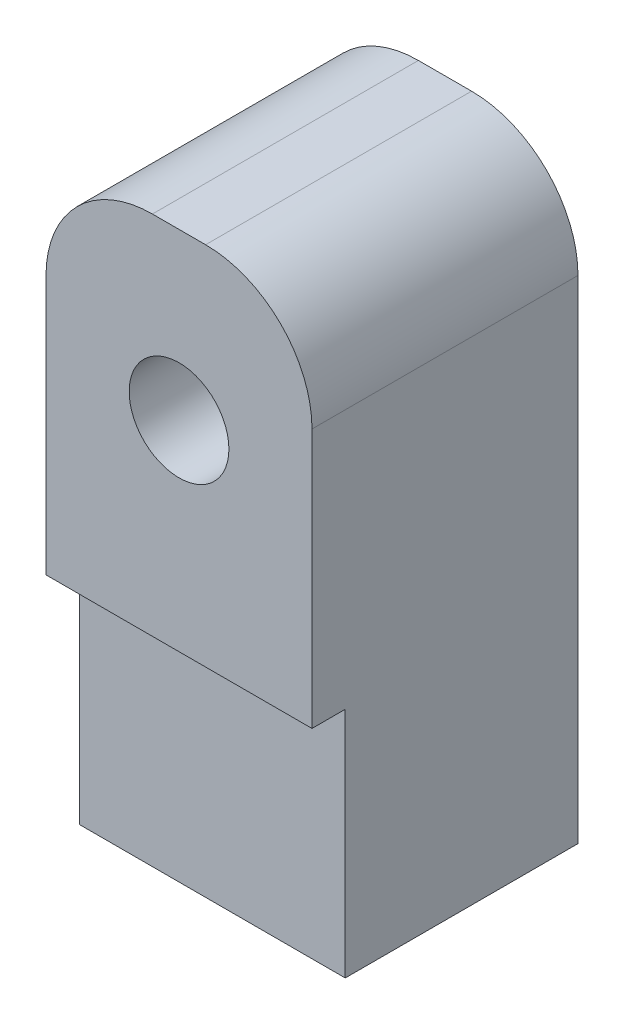
ISO-10303-21;
HEADER;
FILE_DESCRIPTION(('STEP AP214'),'2;1');
FILE_NAME('part.step','',(''),(''),'','','');
FILE_SCHEMA(('AUTOMOTIVE_DESIGN { 1 0 10303 214 1 1 1 1 }'));
ENDSEC;
DATA;
#1=APPLICATION_CONTEXT('core data for automotive mechanical design processes');
#2=APPLICATION_PROTOCOL_DEFINITION('international standard','automotive_design',2000,#1);
#3=PRODUCT_CONTEXT('',#1,'mechanical');
#4=PRODUCT('Part','Part','',(#3));
#5=PRODUCT_RELATED_PRODUCT_CATEGORY('part','',(#4));
#6=PRODUCT_DEFINITION_FORMATION('','',#4);
#7=PRODUCT_DEFINITION_CONTEXT('part definition',#1,'design');
#8=PRODUCT_DEFINITION('design','',#6,#7);
#9=PRODUCT_DEFINITION_SHAPE('','',#8);
#10=(LENGTH_UNIT() NAMED_UNIT(*) SI_UNIT(.MILLI.,.METRE.));
#11=(NAMED_UNIT(*) PLANE_ANGLE_UNIT() SI_UNIT($,.RADIAN.));
#12=(NAMED_UNIT(*) SI_UNIT($,.STERADIAN.) SOLID_ANGLE_UNIT());
#13=UNCERTAINTY_MEASURE_WITH_UNIT(LENGTH_MEASURE(1.E-05),#10,'distance_accuracy_value','');
#14=(GEOMETRIC_REPRESENTATION_CONTEXT(3) GLOBAL_UNCERTAINTY_ASSIGNED_CONTEXT((#13)) GLOBAL_UNIT_ASSIGNED_CONTEXT((#10,
#11,#12)) REPRESENTATION_CONTEXT('',''));
#15=CARTESIAN_POINT('',(0.,0.,0.));
#16=DIRECTION('',(0.,0.,1.));
#17=DIRECTION('',(1.,0.,0.));
#18=AXIS2_PLACEMENT_3D('',#15,#16,#17);
#19=CARTESIAN_POINT('',(0.00208552515346321,41.3626449830756,-12.7));
#20=DIRECTION('',(0.,0.,1.));
#21=DIRECTION('',(1.,0.,0.));
#22=AXIS2_PLACEMENT_3D('',#19,#20,#21);
#23=CYLINDRICAL_SURFACE('',#22,4.7625);
#24=CARTESIAN_POINT('',(0.00208552515346321,41.3626449830756,12.7));
#25=DIRECTION('',(0.,0.,1.));
#26=DIRECTION('',(1.,0.,0.));
#27=AXIS2_PLACEMENT_3D('',#24,#25,#26);
#28=CIRCLE('',#27,4.7625);
#29=CARTESIAN_POINT('',(4.76458552515346,41.3626449830756,12.7));
#30=VERTEX_POINT('',#29);
#31=EDGE_CURVE('E152',#30,#30,#28,.T.);
#32=ORIENTED_EDGE('',*,*,#31,.T.);
#33=EDGE_LOOP('',(#32));
#34=FACE_BOUND('',#33,.T.);
#35=CARTESIAN_POINT('',(0.00208552515346321,41.3626449830756,-9.525));
#36=DIRECTION('',(0.,0.,-1.));
#37=DIRECTION('',(-1.,0.,0.));
#38=AXIS2_PLACEMENT_3D('',#35,#36,#37);
#39=CIRCLE('',#38,4.7625);
#40=CARTESIAN_POINT('',(-4.76041447484654,41.3626449830756,-9.525));
#41=VERTEX_POINT('',#40);
#42=EDGE_CURVE('E149',#41,#41,#39,.F.);
#43=ORIENTED_EDGE('',*,*,#42,.F.);
#44=EDGE_LOOP('',(#43));
#45=FACE_BOUND('',#44,.T.);
#46=ADVANCED_FACE('F33',(#34,#45),#23,.F.);
#47=CARTESIAN_POINT('',(-12.7,57.15,12.7));
#48=DIRECTION('',(0.,0.,-1.));
#49=DIRECTION('',(-1.,0.,0.));
#50=AXIS2_PLACEMENT_3D('',#47,#48,#49);
#51=PLANE('',#50);
#52=ORIENTED_EDGE('',*,*,#31,.F.);
#53=EDGE_LOOP('',(#52));
#54=FACE_BOUND('',#53,.T.);
#55=DIRECTION('',(1.,0.,0.));
#56=VECTOR('',#55,1.);
#57=CARTESIAN_POINT('',(-12.7,57.15,12.7));
#58=LINE('',#57,#56);
#59=CARTESIAN_POINT('',(-2.53999999999999,57.15,12.7));
#60=VERTEX_POINT('',#59);
#61=CARTESIAN_POINT('',(2.54000000000001,57.15,12.7));
#62=VERTEX_POINT('',#61);
#63=EDGE_CURVE('E131',#60,#62,#58,.T.);
#64=ORIENTED_EDGE('',*,*,#63,.F.);
#65=CARTESIAN_POINT('',(-2.53999999999999,46.99,12.7));
#66=DIRECTION('',(0.,0.,-1.));
#67=DIRECTION('',(-1.,0.,0.));
#68=AXIS2_PLACEMENT_3D('',#65,#66,#67);
#69=CIRCLE('',#68,10.16);
#70=CARTESIAN_POINT('',(-12.7,46.99,12.7));
#71=VERTEX_POINT('',#70);
#72=EDGE_CURVE('E161',#60,#71,#69,.F.);
#73=ORIENTED_EDGE('',*,*,#72,.T.);
#74=DIRECTION('',(0.,-1.,0.));
#75=VECTOR('',#74,1.);
#76=CARTESIAN_POINT('',(-12.7,57.15,12.7));
#77=LINE('',#76,#75);
#78=CARTESIAN_POINT('',(-12.7,22.225,12.7));
#79=VERTEX_POINT('',#78);
#80=EDGE_CURVE('E142',#71,#79,#77,.T.);
#81=ORIENTED_EDGE('',*,*,#80,.T.);
#82=DIRECTION('',(-1.,0.,0.));
#83=VECTOR('',#82,1.);
#84=CARTESIAN_POINT('',(12.7,22.225,12.7));
#85=LINE('',#84,#83);
#86=CARTESIAN_POINT('',(12.7,22.225,12.7));
#87=VERTEX_POINT('',#86);
#88=EDGE_CURVE('E115',#87,#79,#85,.T.);
#89=ORIENTED_EDGE('',*,*,#88,.F.);
#90=DIRECTION('',(0.,-1.,0.));
#91=VECTOR('',#90,1.);
#92=CARTESIAN_POINT('',(12.7,57.15,12.7));
#93=LINE('',#92,#91);
#94=CARTESIAN_POINT('',(12.7,46.99,12.7));
#95=VERTEX_POINT('',#94);
#96=EDGE_CURVE('E134',#95,#87,#93,.T.);
#97=ORIENTED_EDGE('',*,*,#96,.F.);
#98=CARTESIAN_POINT('',(2.54000000000001,46.99,12.7));
#99=DIRECTION('',(0.,0.,-1.));
#100=DIRECTION('',(-1.,0.,0.));
#101=AXIS2_PLACEMENT_3D('',#98,#99,#100);
#102=CIRCLE('',#101,10.16);
#103=EDGE_CURVE('E159',#95,#62,#102,.F.);
#104=ORIENTED_EDGE('',*,*,#103,.T.);
#105=EDGE_LOOP('',(#64,#73,#81,#89,#97,#104));
#106=FACE_BOUND('',#105,.T.);
#107=ADVANCED_FACE('F174',(#54,#106),#51,.F.);
#108=CARTESIAN_POINT('',(12.7,57.15,12.7));
#109=DIRECTION('',(-1.,0.,0.));
#110=DIRECTION('',(0.,0.,1.));
#111=AXIS2_PLACEMENT_3D('',#108,#109,#110);
#112=PLANE('',#111);
#113=DIRECTION('',(0.,-1.,0.));
#114=VECTOR('',#113,1.);
#115=CARTESIAN_POINT('',(12.7,57.15,-12.7));
#116=LINE('',#115,#114);
#117=CARTESIAN_POINT('',(12.7,46.99,-12.7));
#118=VERTEX_POINT('',#117);
#119=CARTESIAN_POINT('',(12.7,0.,-12.7));
#120=VERTEX_POINT('',#119);
#121=EDGE_CURVE('E146',#118,#120,#116,.T.);
#122=ORIENTED_EDGE('',*,*,#121,.F.);
#123=DIRECTION('',(0.,0.,-1.));
#124=VECTOR('',#123,1.);
#125=CARTESIAN_POINT('',(12.7,46.99,12.7));
#126=LINE('',#125,#124);
#127=EDGE_CURVE('E11',#118,#95,#126,.F.);
#128=ORIENTED_EDGE('',*,*,#127,.T.);
#129=ORIENTED_EDGE('',*,*,#96,.T.);
#130=DIRECTION('',(0.,0.,1.));
#131=VECTOR('',#130,1.);
#132=CARTESIAN_POINT('',(12.7,22.225,9.525));
#133=LINE('',#132,#131);
#134=CARTESIAN_POINT('',(12.7,22.225,9.525));
#135=VERTEX_POINT('',#134);
#136=EDGE_CURVE('E108',#135,#87,#133,.T.);
#137=ORIENTED_EDGE('',*,*,#136,.F.);
#138=DIRECTION('',(0.,-1.,0.));
#139=VECTOR('',#138,1.);
#140=CARTESIAN_POINT('',(12.7,22.225,9.525));
#141=LINE('',#140,#139);
#142=CARTESIAN_POINT('',(12.7,0.,9.525));
#143=VERTEX_POINT('',#142);
#144=EDGE_CURVE('E104',#135,#143,#141,.T.);
#145=ORIENTED_EDGE('',*,*,#144,.T.);
#146=DIRECTION('',(0.,0.,-1.));
#147=VECTOR('',#146,1.);
#148=CARTESIAN_POINT('',(12.7,0.,12.7));
#149=LINE('',#148,#147);
#150=EDGE_CURVE('E123',#143,#120,#149,.T.);
#151=ORIENTED_EDGE('',*,*,#150,.T.);
#152=EDGE_LOOP('',(#122,#128,#129,#137,#145,#151));
#153=FACE_BOUND('',#152,.T.);
#154=ADVANCED_FACE('F180',(#153),#112,.F.);
#155=CARTESIAN_POINT('',(-12.7,57.15,-12.7));
#156=DIRECTION('',(0.,0.,1.));
#157=DIRECTION('',(1.,0.,0.));
#158=AXIS2_PLACEMENT_3D('',#155,#156,#157);
#159=PLANE('',#158);
#160=CARTESIAN_POINT('',(0.00208552515346321,41.3626449830756,-12.7));
#161=DIRECTION('',(0.,0.,-1.));
#162=DIRECTION('',(-1.,0.,0.));
#163=AXIS2_PLACEMENT_3D('',#160,#161,#162);
#164=CIRCLE('',#163,6.0325);
#165=CARTESIAN_POINT('',(-6.03041447484654,41.3626449830756,-12.7));
#166=VERTEX_POINT('',#165);
#167=EDGE_CURVE('E189',#166,#166,#164,.T.);
#168=ORIENTED_EDGE('',*,*,#167,.F.);
#169=EDGE_LOOP('',(#168));
#170=FACE_BOUND('',#169,.T.);
#171=DIRECTION('',(0.,-1.,0.));
#172=VECTOR('',#171,1.);
#173=CARTESIAN_POINT('',(-12.7,57.15,-12.7));
#174=LINE('',#173,#172);
#175=CARTESIAN_POINT('',(-12.7,46.99,-12.7));
#176=VERTEX_POINT('',#175);
#177=CARTESIAN_POINT('',(-12.7,0.,-12.7));
#178=VERTEX_POINT('',#177);
#179=EDGE_CURVE('E144',#176,#178,#174,.T.);
#180=ORIENTED_EDGE('',*,*,#179,.F.);
#181=CARTESIAN_POINT('',(-2.53999999999999,46.99,-12.7));
#182=DIRECTION('',(0.,0.,1.));
#183=DIRECTION('',(1.,0.,0.));
#184=AXIS2_PLACEMENT_3D('',#181,#182,#183);
#185=CIRCLE('',#184,10.16);
#186=CARTESIAN_POINT('',(-2.53999999999999,57.15,-12.7));
#187=VERTEX_POINT('',#186);
#188=EDGE_CURVE('E41',#176,#187,#185,.F.);
#189=ORIENTED_EDGE('',*,*,#188,.T.);
#190=DIRECTION('',(-1.,0.,0.));
#191=VECTOR('',#190,1.);
#192=CARTESIAN_POINT('',(-12.7,57.15,-12.7));
#193=LINE('',#192,#191);
#194=CARTESIAN_POINT('',(2.54000000000001,57.15,-12.7));
#195=VERTEX_POINT('',#194);
#196=EDGE_CURVE('E128',#195,#187,#193,.T.);
#197=ORIENTED_EDGE('',*,*,#196,.F.);
#198=CARTESIAN_POINT('',(2.54000000000001,46.99,-12.7));
#199=DIRECTION('',(0.,0.,1.));
#200=DIRECTION('',(1.,0.,0.));
#201=AXIS2_PLACEMENT_3D('',#198,#199,#200);
#202=CIRCLE('',#201,10.16);
#203=EDGE_CURVE('E48',#195,#118,#202,.F.);
#204=ORIENTED_EDGE('',*,*,#203,.T.);
#205=ORIENTED_EDGE('',*,*,#121,.T.);
#206=DIRECTION('',(-1.,0.,0.));
#207=VECTOR('',#206,1.);
#208=CARTESIAN_POINT('',(-12.7,0.,-12.7));
#209=LINE('',#208,#207);
#210=EDGE_CURVE('E137',#120,#178,#209,.T.);
#211=ORIENTED_EDGE('',*,*,#210,.T.);
#212=EDGE_LOOP('',(#180,#189,#197,#204,#205,#211));
#213=FACE_BOUND('',#212,.T.);
#214=ADVANCED_FACE('F165',(#170,#213),#159,.F.);
#215=CARTESIAN_POINT('',(-12.7,57.15,12.7));
#216=DIRECTION('',(1.,0.,0.));
#217=DIRECTION('',(0.,0.,-1.));
#218=AXIS2_PLACEMENT_3D('',#215,#216,#217);
#219=PLANE('',#218);
#220=ORIENTED_EDGE('',*,*,#80,.F.);
#221=DIRECTION('',(0.,0.,1.));
#222=VECTOR('',#221,1.);
#223=CARTESIAN_POINT('',(-12.7,46.99,12.7));
#224=LINE('',#223,#222);
#225=EDGE_CURVE('E56',#71,#176,#224,.F.);
#226=ORIENTED_EDGE('',*,*,#225,.T.);
#227=ORIENTED_EDGE('',*,*,#179,.T.);
#228=DIRECTION('',(0.,0.,1.));
#229=VECTOR('',#228,1.);
#230=CARTESIAN_POINT('',(-12.7,0.,12.7));
#231=LINE('',#230,#229);
#232=CARTESIAN_POINT('',(-12.7,0.,9.525));
#233=VERTEX_POINT('',#232);
#234=EDGE_CURVE('E121',#178,#233,#231,.T.);
#235=ORIENTED_EDGE('',*,*,#234,.T.);
#236=DIRECTION('',(0.,-1.,0.));
#237=VECTOR('',#236,1.);
#238=CARTESIAN_POINT('',(-12.7,22.225,9.525));
#239=LINE('',#238,#237);
#240=CARTESIAN_POINT('',(-12.7,22.225,9.525));
#241=VERTEX_POINT('',#240);
#242=EDGE_CURVE('E101',#241,#233,#239,.T.);
#243=ORIENTED_EDGE('',*,*,#242,.F.);
#244=DIRECTION('',(0.,0.,-1.));
#245=VECTOR('',#244,1.);
#246=CARTESIAN_POINT('',(-12.7,22.225,12.7));
#247=LINE('',#246,#245);
#248=EDGE_CURVE('E109',#79,#241,#247,.T.);
#249=ORIENTED_EDGE('',*,*,#248,.F.);
#250=EDGE_LOOP('',(#220,#226,#227,#235,#243,#249));
#251=FACE_BOUND('',#250,.T.);
#252=ADVANCED_FACE('F119',(#251),#219,.F.);
#253=CARTESIAN_POINT('',(0.,57.15,0.));
#254=DIRECTION('',(0.,-1.,0.));
#255=DIRECTION('',(0.,0.,-1.));
#256=AXIS2_PLACEMENT_3D('',#253,#254,#255);
#257=PLANE('',#256);
#258=ORIENTED_EDGE('',*,*,#196,.T.);
#259=DIRECTION('',(0.,0.,1.));
#260=VECTOR('',#259,1.);
#261=CARTESIAN_POINT('',(-2.53999999999999,57.15,0.));
#262=LINE('',#261,#260);
#263=EDGE_CURVE('E156',#187,#60,#262,.T.);
#264=ORIENTED_EDGE('',*,*,#263,.T.);
#265=ORIENTED_EDGE('',*,*,#63,.T.);
#266=DIRECTION('',(0.,0.,-1.));
#267=VECTOR('',#266,1.);
#268=CARTESIAN_POINT('',(2.54000000000001,57.15,0.));
#269=LINE('',#268,#267);
#270=EDGE_CURVE('E148',#62,#195,#269,.T.);
#271=ORIENTED_EDGE('',*,*,#270,.T.);
#272=EDGE_LOOP('',(#258,#264,#265,#271));
#273=FACE_BOUND('',#272,.T.);
#274=ADVANCED_FACE('F169',(#273),#257,.F.);
#275=CARTESIAN_POINT('',(0.,0.,0.));
#276=DIRECTION('',(0.,-1.,0.));
#277=DIRECTION('',(0.,0.,-1.));
#278=AXIS2_PLACEMENT_3D('',#275,#276,#277);
#279=PLANE('',#278);
#280=CARTESIAN_POINT('',(0.,0.,0.));
#281=DIRECTION('',(0.,-1.,0.));
#282=DIRECTION('',(0.,0.,-1.));
#283=AXIS2_PLACEMENT_3D('',#280,#281,#282);
#284=CIRCLE('',#283,6.35);
#285=CARTESIAN_POINT('',(0.,0.,-6.35));
#286=VERTEX_POINT('',#285);
#287=EDGE_CURVE('E195',#286,#286,#284,.T.);
#288=ORIENTED_EDGE('',*,*,#287,.F.);
#289=EDGE_LOOP('',(#288));
#290=FACE_BOUND('',#289,.T.);
#291=DIRECTION('',(1.,0.,0.));
#292=VECTOR('',#291,1.);
#293=CARTESIAN_POINT('',(-12.7,0.,9.525));
#294=LINE('',#293,#292);
#295=EDGE_CURVE('E116',#233,#143,#294,.T.);
#296=ORIENTED_EDGE('',*,*,#295,.F.);
#297=ORIENTED_EDGE('',*,*,#234,.F.);
#298=ORIENTED_EDGE('',*,*,#210,.F.);
#299=ORIENTED_EDGE('',*,*,#150,.F.);
#300=EDGE_LOOP('',(#296,#297,#298,#299));
#301=FACE_BOUND('',#300,.T.);
#302=ADVANCED_FACE('F184',(#290,#301),#279,.T.);
#303=CARTESIAN_POINT('',(-12.7,22.225,9.525));
#304=DIRECTION('',(0.,0.,-1.));
#305=DIRECTION('',(-1.,0.,0.));
#306=AXIS2_PLACEMENT_3D('',#303,#304,#305);
#307=PLANE('',#306);
#308=ORIENTED_EDGE('',*,*,#295,.T.);
#309=ORIENTED_EDGE('',*,*,#144,.F.);
#310=DIRECTION('',(1.,0.,0.));
#311=VECTOR('',#310,1.);
#312=CARTESIAN_POINT('',(-12.7,22.225,9.525));
#313=LINE('',#312,#311);
#314=EDGE_CURVE('E97',#241,#135,#313,.T.);
#315=ORIENTED_EDGE('',*,*,#314,.F.);
#316=ORIENTED_EDGE('',*,*,#242,.T.);
#317=EDGE_LOOP('',(#308,#309,#315,#316));
#318=FACE_BOUND('',#317,.T.);
#319=ADVANCED_FACE('F99',(#318),#307,.F.);
#320=CARTESIAN_POINT('',(0.,22.225,0.));
#321=DIRECTION('',(0.,-1.,0.));
#322=DIRECTION('',(0.,0.,-1.));
#323=AXIS2_PLACEMENT_3D('',#320,#321,#322);
#324=PLANE('',#323);
#325=ORIENTED_EDGE('',*,*,#248,.T.);
#326=ORIENTED_EDGE('',*,*,#314,.T.);
#327=ORIENTED_EDGE('',*,*,#136,.T.);
#328=ORIENTED_EDGE('',*,*,#88,.T.);
#329=EDGE_LOOP('',(#325,#326,#327,#328));
#330=FACE_BOUND('',#329,.T.);
#331=ADVANCED_FACE('F113',(#330),#324,.T.);
#332=CARTESIAN_POINT('',(0.00208552515346321,41.3626449830756,-9.525));
#333=DIRECTION('',(0.,0.,-1.));
#334=DIRECTION('',(-1.,0.,0.));
#335=AXIS2_PLACEMENT_3D('',#332,#333,#334);
#336=PLANE('',#335);
#337=CARTESIAN_POINT('',(0.00208552515346321,41.3626449830756,-9.525));
#338=DIRECTION('',(0.,0.,-1.));
#339=DIRECTION('',(-1.,0.,0.));
#340=AXIS2_PLACEMENT_3D('',#337,#338,#339);
#341=CIRCLE('',#340,6.0325);
#342=CARTESIAN_POINT('',(-6.03041447484654,41.3626449830756,-9.525));
#343=VERTEX_POINT('',#342);
#344=EDGE_CURVE('E153',#343,#343,#341,.T.);
#345=ORIENTED_EDGE('',*,*,#344,.T.);
#346=EDGE_LOOP('',(#345));
#347=FACE_BOUND('',#346,.T.);
#348=ORIENTED_EDGE('',*,*,#42,.T.);
#349=EDGE_LOOP('',(#348));
#350=FACE_BOUND('',#349,.T.);
#351=ADVANCED_FACE('F231',(#347,#350),#336,.T.);
#352=CARTESIAN_POINT('',(0.00208552515346321,41.3626449830756,-9.525));
#353=DIRECTION('',(0.,0.,-1.));
#354=DIRECTION('',(-1.,0.,0.));
#355=AXIS2_PLACEMENT_3D('',#352,#353,#354);
#356=CYLINDRICAL_SURFACE('',#355,6.0325);
#357=ORIENTED_EDGE('',*,*,#344,.F.);
#358=EDGE_LOOP('',(#357));
#359=FACE_BOUND('',#358,.T.);
#360=ORIENTED_EDGE('',*,*,#167,.T.);
#361=EDGE_LOOP('',(#360));
#362=FACE_BOUND('',#361,.T.);
#363=ADVANCED_FACE('F206',(#359,#362),#356,.F.);
#364=CARTESIAN_POINT('',(0.,30.1752,0.));
#365=DIRECTION('',(0.,-1.,0.));
#366=DIRECTION('',(0.,0.,-1.));
#367=AXIS2_PLACEMENT_3D('',#364,#365,#366);
#368=CYLINDRICAL_SURFACE('',#367,6.35);
#369=CARTESIAN_POINT('',(0.,30.1752,0.));
#370=DIRECTION('',(0.,-1.,0.));
#371=DIRECTION('',(0.,0.,-1.));
#372=AXIS2_PLACEMENT_3D('',#369,#370,#371);
#373=CIRCLE('',#372,6.35);
#374=CARTESIAN_POINT('',(0.,30.1752,-6.35));
#375=VERTEX_POINT('',#374);
#376=EDGE_CURVE('E192',#375,#375,#373,.T.);
#377=ORIENTED_EDGE('',*,*,#376,.F.);
#378=EDGE_LOOP('',(#377));
#379=FACE_BOUND('',#378,.T.);
#380=ORIENTED_EDGE('',*,*,#287,.T.);
#381=EDGE_LOOP('',(#380));
#382=FACE_BOUND('',#381,.T.);
#383=ADVANCED_FACE('F203',(#379,#382),#368,.F.);
#384=CARTESIAN_POINT('',(0.,30.1752,0.));
#385=DIRECTION('',(0.,-1.,0.));
#386=DIRECTION('',(0.,0.,-1.));
#387=AXIS2_PLACEMENT_3D('',#384,#385,#386);
#388=PLANE('',#387);
#389=ORIENTED_EDGE('',*,*,#376,.T.);
#390=EDGE_LOOP('',(#389));
#391=FACE_BOUND('',#390,.T.);
#392=ADVANCED_FACE('F201',(#391),#388,.T.);
#393=CARTESIAN_POINT('',(-2.53999999999999,46.99,0.));
#394=DIRECTION('',(0.,0.,1.));
#395=DIRECTION('',(1.,0.,0.));
#396=AXIS2_PLACEMENT_3D('',#393,#394,#395);
#397=CYLINDRICAL_SURFACE('',#396,10.16);
#398=ORIENTED_EDGE('',*,*,#188,.F.);
#399=ORIENTED_EDGE('',*,*,#225,.F.);
#400=ORIENTED_EDGE('',*,*,#72,.F.);
#401=ORIENTED_EDGE('',*,*,#263,.F.);
#402=EDGE_LOOP('',(#398,#399,#400,#401));
#403=FACE_BOUND('',#402,.T.);
#404=ADVANCED_FACE('F172',(#403),#397,.T.);
#405=CARTESIAN_POINT('',(2.54000000000001,46.99,0.));
#406=DIRECTION('',(0.,0.,-1.));
#407=DIRECTION('',(-1.,0.,0.));
#408=AXIS2_PLACEMENT_3D('',#405,#406,#407);
#409=CYLINDRICAL_SURFACE('',#408,10.16);
#410=ORIENTED_EDGE('',*,*,#103,.F.);
#411=ORIENTED_EDGE('',*,*,#127,.F.);
#412=ORIENTED_EDGE('',*,*,#203,.F.);
#413=ORIENTED_EDGE('',*,*,#270,.F.);
#414=EDGE_LOOP('',(#410,#411,#412,#413));
#415=FACE_BOUND('',#414,.T.);
#416=ADVANCED_FACE('F35',(#415),#409,.T.);
#417=CLOSED_SHELL('',(#46,#107,#154,#214,#252,#274,#302,#319,#331,#351,#363,#383,#392,#404,#416));
#418=MANIFOLD_SOLID_BREP('B2',#417);
#419=ADVANCED_BREP_SHAPE_REPRESENTATION('',(#18,#418),#14);
#420=SHAPE_DEFINITION_REPRESENTATION(#9,#419);
ENDSEC;
END-ISO-10303-21;
